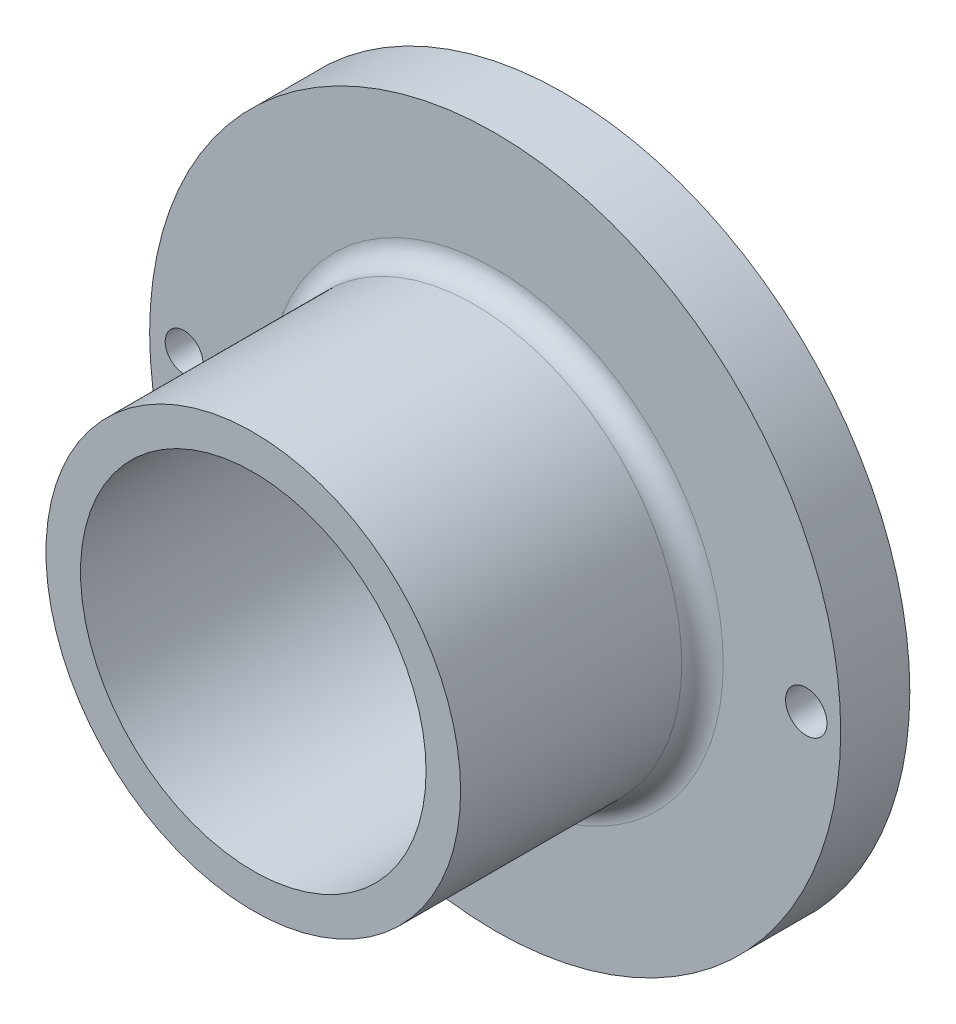
ISO-10303-21;
HEADER;
FILE_DESCRIPTION(('STEP AP214'),'2;1');
FILE_NAME('part.step','',(''),(''),'','','');
FILE_SCHEMA(('AUTOMOTIVE_DESIGN { 1 0 10303 214 1 1 1 1 }'));
ENDSEC;
DATA;
#1=APPLICATION_CONTEXT('core data for automotive mechanical design processes');
#2=APPLICATION_PROTOCOL_DEFINITION('international standard','automotive_design',2000,#1);
#3=PRODUCT_CONTEXT('',#1,'mechanical');
#4=PRODUCT('Part','Part','',(#3));
#5=PRODUCT_RELATED_PRODUCT_CATEGORY('part','',(#4));
#6=PRODUCT_DEFINITION_FORMATION('','',#4);
#7=PRODUCT_DEFINITION_CONTEXT('part definition',#1,'design');
#8=PRODUCT_DEFINITION('design','',#6,#7);
#9=PRODUCT_DEFINITION_SHAPE('','',#8);
#10=(LENGTH_UNIT() NAMED_UNIT(*) SI_UNIT(.MILLI.,.METRE.));
#11=(NAMED_UNIT(*) PLANE_ANGLE_UNIT() SI_UNIT($,.RADIAN.));
#12=(NAMED_UNIT(*) SI_UNIT($,.STERADIAN.) SOLID_ANGLE_UNIT());
#13=UNCERTAINTY_MEASURE_WITH_UNIT(LENGTH_MEASURE(1.E-05),#10,'distance_accuracy_value','');
#14=(GEOMETRIC_REPRESENTATION_CONTEXT(3) GLOBAL_UNCERTAINTY_ASSIGNED_CONTEXT((#13)) GLOBAL_UNIT_ASSIGNED_CONTEXT((#10,
#11,#12)) REPRESENTATION_CONTEXT('',''));
#15=CARTESIAN_POINT('',(0.,0.,0.));
#16=DIRECTION('',(0.,0.,1.));
#17=DIRECTION('',(1.,0.,0.));
#18=AXIS2_PLACEMENT_3D('',#15,#16,#17);
#19=CARTESIAN_POINT('',(0.,0.,10.));
#20=DIRECTION('',(0.,0.,1.));
#21=DIRECTION('',(1.,0.,0.));
#22=AXIS2_PLACEMENT_3D('',#19,#20,#21);
#23=PLANE('',#22);
#24=CARTESIAN_POINT('',(45.0164916825545,0.,10.));
#25=DIRECTION('',(0.,0.,1.));
#26=DIRECTION('',(1.,0.,0.));
#27=AXIS2_PLACEMENT_3D('',#24,#25,#26);
#28=CIRCLE('',#27,3.);
#29=CARTESIAN_POINT('',(48.0164916825545,0.,10.));
#30=VERTEX_POINT('',#29);
#31=EDGE_CURVE('E75',#30,#30,#28,.F.);
#32=ORIENTED_EDGE('',*,*,#31,.T.);
#33=EDGE_LOOP('',(#32));
#34=FACE_BOUND('',#33,.T.);
#35=CARTESIAN_POINT('',(-45.0164916825545,0.,10.));
#36=DIRECTION('',(0.,0.,1.));
#37=DIRECTION('',(1.,0.,0.));
#38=AXIS2_PLACEMENT_3D('',#35,#36,#37);
#39=CIRCLE('',#38,2.72894142294607);
#40=CARTESIAN_POINT('',(-42.2875502596085,0.,10.));
#41=VERTEX_POINT('',#40);
#42=EDGE_CURVE('E79',#41,#41,#39,.F.);
#43=ORIENTED_EDGE('',*,*,#42,.T.);
#44=EDGE_LOOP('',(#43));
#45=FACE_BOUND('',#44,.T.);
#46=CARTESIAN_POINT('',(0.,0.,10.));
#47=DIRECTION('',(0.,0.,1.));
#48=DIRECTION('',(1.,0.,0.));
#49=AXIS2_PLACEMENT_3D('',#46,#47,#48);
#50=CIRCLE('',#49,33.);
#51=CARTESIAN_POINT('',(33.,0.,10.));
#52=VERTEX_POINT('',#51);
#53=EDGE_CURVE('E47',#52,#52,#50,.F.);
#54=ORIENTED_EDGE('',*,*,#53,.T.);
#55=EDGE_LOOP('',(#54));
#56=FACE_BOUND('',#55,.T.);
#57=CARTESIAN_POINT('',(0.,0.,10.));
#58=DIRECTION('',(0.,0.,1.));
#59=DIRECTION('',(1.,0.,0.));
#60=AXIS2_PLACEMENT_3D('',#57,#58,#59);
#61=CIRCLE('',#60,50.);
#62=CARTESIAN_POINT('',(50.,0.,10.));
#63=VERTEX_POINT('',#62);
#64=EDGE_CURVE('E52',#63,#63,#61,.T.);
#65=ORIENTED_EDGE('',*,*,#64,.T.);
#66=EDGE_LOOP('',(#65));
#67=FACE_BOUND('',#66,.T.);
#68=ADVANCED_FACE('F39',(#34,#45,#56,#67),#23,.T.);
#69=CARTESIAN_POINT('',(0.,0.,0.));
#70=DIRECTION('',(0.,0.,1.));
#71=DIRECTION('',(1.,0.,0.));
#72=AXIS2_PLACEMENT_3D('',#69,#70,#71);
#73=PLANE('',#72);
#74=CARTESIAN_POINT('',(45.0164916825545,0.,0.));
#75=DIRECTION('',(0.,0.,1.));
#76=DIRECTION('',(1.,0.,0.));
#77=AXIS2_PLACEMENT_3D('',#74,#75,#76);
#78=CIRCLE('',#77,3.);
#79=CARTESIAN_POINT('',(48.0164916825545,0.,0.));
#80=VERTEX_POINT('',#79);
#81=EDGE_CURVE('E83',#80,#80,#78,.T.);
#82=ORIENTED_EDGE('',*,*,#81,.T.);
#83=EDGE_LOOP('',(#82));
#84=FACE_BOUND('',#83,.T.);
#85=CARTESIAN_POINT('',(-45.0164916825545,0.,0.));
#86=DIRECTION('',(0.,0.,1.));
#87=DIRECTION('',(1.,0.,0.));
#88=AXIS2_PLACEMENT_3D('',#85,#86,#87);
#89=CIRCLE('',#88,2.72894142294607);
#90=CARTESIAN_POINT('',(-42.2875502596085,0.,0.));
#91=VERTEX_POINT('',#90);
#92=EDGE_CURVE('E84',#91,#91,#89,.T.);
#93=ORIENTED_EDGE('',*,*,#92,.T.);
#94=EDGE_LOOP('',(#93));
#95=FACE_BOUND('',#94,.T.);
#96=CARTESIAN_POINT('',(0.,0.,0.));
#97=DIRECTION('',(0.,0.,1.));
#98=DIRECTION('',(1.,0.,0.));
#99=AXIS2_PLACEMENT_3D('',#96,#97,#98);
#100=CIRCLE('',#99,25.);
#101=CARTESIAN_POINT('',(25.,0.,0.));
#102=VERTEX_POINT('',#101);
#103=EDGE_CURVE('E62',#102,#102,#100,.T.);
#104=ORIENTED_EDGE('',*,*,#103,.T.);
#105=EDGE_LOOP('',(#104));
#106=FACE_BOUND('',#105,.T.);
#107=CARTESIAN_POINT('',(0.,0.,0.));
#108=DIRECTION('',(0.,0.,1.));
#109=DIRECTION('',(1.,0.,0.));
#110=AXIS2_PLACEMENT_3D('',#107,#108,#109);
#111=CIRCLE('',#110,50.);
#112=CARTESIAN_POINT('',(50.,0.,0.));
#113=VERTEX_POINT('',#112);
#114=EDGE_CURVE('E57',#113,#113,#111,.T.);
#115=ORIENTED_EDGE('',*,*,#114,.F.);
#116=EDGE_LOOP('',(#115));
#117=FACE_BOUND('',#116,.T.);
#118=ADVANCED_FACE('F92',(#84,#95,#106,#117),#73,.F.);
#119=CARTESIAN_POINT('',(0.,0.,10.));
#120=DIRECTION('',(0.,0.,-1.));
#121=DIRECTION('',(-1.,0.,0.));
#122=AXIS2_PLACEMENT_3D('',#119,#120,#121);
#123=CYLINDRICAL_SURFACE('',#122,50.);
#124=ORIENTED_EDGE('',*,*,#64,.F.);
#125=EDGE_LOOP('',(#124));
#126=FACE_BOUND('',#125,.T.);
#127=ORIENTED_EDGE('',*,*,#114,.T.);
#128=EDGE_LOOP('',(#127));
#129=FACE_BOUND('',#128,.T.);
#130=ADVANCED_FACE('F112',(#126,#129),#123,.T.);
#131=CARTESIAN_POINT('',(0.,0.,10.));
#132=DIRECTION('',(0.,0.,-1.));
#133=DIRECTION('',(-1.,0.,0.));
#134=AXIS2_PLACEMENT_3D('',#131,#132,#133);
#135=CYLINDRICAL_SURFACE('',#134,25.);
#136=ORIENTED_EDGE('',*,*,#103,.F.);
#137=EDGE_LOOP('',(#136));
#138=FACE_BOUND('',#137,.T.);
#139=CARTESIAN_POINT('',(0.,0.,45.));
#140=DIRECTION('',(0.,0.,1.));
#141=DIRECTION('',(1.,0.,0.));
#142=AXIS2_PLACEMENT_3D('',#139,#140,#141);
#143=CIRCLE('',#142,25.);
#144=CARTESIAN_POINT('',(25.,0.,45.));
#145=VERTEX_POINT('',#144);
#146=EDGE_CURVE('E71',#145,#145,#143,.T.);
#147=ORIENTED_EDGE('',*,*,#146,.T.);
#148=EDGE_LOOP('',(#147));
#149=FACE_BOUND('',#148,.T.);
#150=ADVANCED_FACE('F116',(#138,#149),#135,.F.);
#151=CARTESIAN_POINT('',(0.,0.,45.));
#152=DIRECTION('',(0.,0.,1.));
#153=DIRECTION('',(1.,0.,0.));
#154=AXIS2_PLACEMENT_3D('',#151,#152,#153);
#155=PLANE('',#154);
#156=CARTESIAN_POINT('',(0.,0.,45.));
#157=DIRECTION('',(0.,0.,1.));
#158=DIRECTION('',(1.,0.,0.));
#159=AXIS2_PLACEMENT_3D('',#156,#157,#158);
#160=CIRCLE('',#159,30.);
#161=CARTESIAN_POINT('',(30.,0.,45.));
#162=VERTEX_POINT('',#161);
#163=EDGE_CURVE('E67',#162,#162,#160,.T.);
#164=ORIENTED_EDGE('',*,*,#163,.T.);
#165=EDGE_LOOP('',(#164));
#166=FACE_BOUND('',#165,.T.);
#167=ORIENTED_EDGE('',*,*,#146,.F.);
#168=EDGE_LOOP('',(#167));
#169=FACE_BOUND('',#168,.T.);
#170=ADVANCED_FACE('F123',(#166,#169),#155,.T.);
#171=CARTESIAN_POINT('',(0.,0.,45.));
#172=DIRECTION('',(0.,0.,-1.));
#173=DIRECTION('',(-1.,0.,0.));
#174=AXIS2_PLACEMENT_3D('',#171,#172,#173);
#175=CYLINDRICAL_SURFACE('',#174,30.);
#176=CARTESIAN_POINT('',(0.,0.,13.));
#177=DIRECTION('',(0.,0.,1.));
#178=DIRECTION('',(1.,0.,0.));
#179=AXIS2_PLACEMENT_3D('',#176,#177,#178);
#180=CIRCLE('',#179,30.);
#181=CARTESIAN_POINT('',(30.,0.,13.));
#182=VERTEX_POINT('',#181);
#183=EDGE_CURVE('E10',#182,#182,#180,.T.);
#184=ORIENTED_EDGE('',*,*,#183,.T.);
#185=EDGE_LOOP('',(#184));
#186=FACE_BOUND('',#185,.T.);
#187=ORIENTED_EDGE('',*,*,#163,.F.);
#188=EDGE_LOOP('',(#187));
#189=FACE_BOUND('',#188,.T.);
#190=ADVANCED_FACE('F133',(#186,#189),#175,.T.);
#191=CARTESIAN_POINT('',(0.,0.,13.));
#192=DIRECTION('',(0.,0.,1.));
#193=DIRECTION('',(1.,0.,0.));
#194=AXIS2_PLACEMENT_3D('',#191,#192,#193);
#195=TOROIDAL_SURFACE('',#194,33.,3.);
#196=ORIENTED_EDGE('',*,*,#183,.F.);
#197=EDGE_LOOP('',(#196));
#198=FACE_BOUND('',#197,.T.);
#199=ORIENTED_EDGE('',*,*,#53,.F.);
#200=EDGE_LOOP('',(#199));
#201=FACE_BOUND('',#200,.T.);
#202=ADVANCED_FACE('F41',(#198,#201),#195,.F.);
#203=CARTESIAN_POINT('',(-45.0164916825545,0.,50.));
#204=DIRECTION('',(0.,0.,-1.));
#205=DIRECTION('',(-1.,0.,0.));
#206=AXIS2_PLACEMENT_3D('',#203,#204,#205);
#207=CYLINDRICAL_SURFACE('',#206,2.72894142294607);
#208=ORIENTED_EDGE('',*,*,#42,.F.);
#209=EDGE_LOOP('',(#208));
#210=FACE_BOUND('',#209,.T.);
#211=ORIENTED_EDGE('',*,*,#92,.F.);
#212=EDGE_LOOP('',(#211));
#213=FACE_BOUND('',#212,.T.);
#214=ADVANCED_FACE('F97',(#210,#213),#207,.F.);
#215=CARTESIAN_POINT('',(45.0164916825545,0.,50.));
#216=DIRECTION('',(0.,0.,-1.));
#217=DIRECTION('',(-1.,0.,0.));
#218=AXIS2_PLACEMENT_3D('',#215,#216,#217);
#219=CYLINDRICAL_SURFACE('',#218,3.);
#220=ORIENTED_EDGE('',*,*,#31,.F.);
#221=EDGE_LOOP('',(#220));
#222=FACE_BOUND('',#221,.T.);
#223=ORIENTED_EDGE('',*,*,#81,.F.);
#224=EDGE_LOOP('',(#223));
#225=FACE_BOUND('',#224,.T.);
#226=ADVANCED_FACE('F95',(#222,#225),#219,.F.);
#227=CLOSED_SHELL('',(#68,#118,#130,#150,#170,#190,#202,#214,#226));
#228=MANIFOLD_SOLID_BREP('B2',#227);
#229=ADVANCED_BREP_SHAPE_REPRESENTATION('',(#18,#228),#14);
#230=SHAPE_DEFINITION_REPRESENTATION(#9,#229);
ENDSEC;
END-ISO-10303-21;
